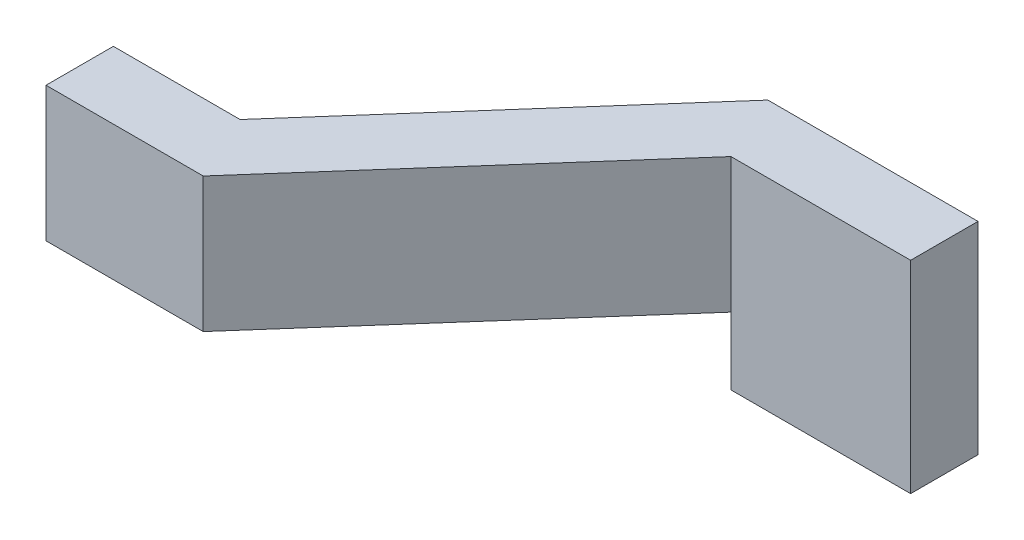
ISO-10303-21;
HEADER;
FILE_DESCRIPTION(('STEP AP214'),'2;1');
FILE_NAME('part.step','',(''),(''),'','','');
FILE_SCHEMA(('AUTOMOTIVE_DESIGN { 1 0 10303 214 1 1 1 1 }'));
ENDSEC;
DATA;
#1=APPLICATION_CONTEXT('core data for automotive mechanical design processes');
#2=APPLICATION_PROTOCOL_DEFINITION('international standard','automotive_design',2000,#1);
#3=PRODUCT_CONTEXT('',#1,'mechanical');
#4=PRODUCT('Part','Part','',(#3));
#5=PRODUCT_RELATED_PRODUCT_CATEGORY('part','',(#4));
#6=PRODUCT_DEFINITION_FORMATION('','',#4);
#7=PRODUCT_DEFINITION_CONTEXT('part definition',#1,'design');
#8=PRODUCT_DEFINITION('design','',#6,#7);
#9=PRODUCT_DEFINITION_SHAPE('','',#8);
#10=(LENGTH_UNIT() NAMED_UNIT(*) SI_UNIT(.MILLI.,.METRE.));
#11=(NAMED_UNIT(*) PLANE_ANGLE_UNIT() SI_UNIT($,.RADIAN.));
#12=(NAMED_UNIT(*) SI_UNIT($,.STERADIAN.) SOLID_ANGLE_UNIT());
#13=UNCERTAINTY_MEASURE_WITH_UNIT(LENGTH_MEASURE(1.E-05),#10,'distance_accuracy_value','');
#14=(GEOMETRIC_REPRESENTATION_CONTEXT(3) GLOBAL_UNCERTAINTY_ASSIGNED_CONTEXT((#13)) GLOBAL_UNIT_ASSIGNED_CONTEXT((#10,
#11,#12)) REPRESENTATION_CONTEXT('',''));
#15=CARTESIAN_POINT('',(0.,0.,0.));
#16=DIRECTION('',(0.,0.,1.));
#17=DIRECTION('',(1.,0.,0.));
#18=AXIS2_PLACEMENT_3D('',#15,#16,#17);
#19=CARTESIAN_POINT('',(0.,0.762,0.));
#20=DIRECTION('',(1.,0.,0.));
#21=DIRECTION('',(0.,0.,-1.));
#22=AXIS2_PLACEMENT_3D('',#19,#20,#21);
#23=PLANE('',#22);
#24=DIRECTION('',(0.,0.,-1.));
#25=VECTOR('',#24,1.);
#26=CARTESIAN_POINT('',(0.,-0.381,0.));
#27=LINE('',#26,#25);
#28=CARTESIAN_POINT('',(0.,-0.381,0.));
#29=VERTEX_POINT('',#28);
#30=CARTESIAN_POINT('',(0.,-0.381,-0.381));
#31=VERTEX_POINT('',#30);
#32=EDGE_CURVE('E196',#29,#31,#27,.T.);
#33=ORIENTED_EDGE('',*,*,#32,.F.);
#34=DIRECTION('',(0.,-1.,0.));
#35=VECTOR('',#34,1.);
#36=CARTESIAN_POINT('',(0.,0.762,0.));
#37=LINE('',#36,#35);
#38=CARTESIAN_POINT('',(0.,0.381,0.));
#39=VERTEX_POINT('',#38);
#40=EDGE_CURVE('E141',#39,#29,#37,.T.);
#41=ORIENTED_EDGE('',*,*,#40,.F.);
#42=DIRECTION('',(0.,0.,-1.));
#43=VECTOR('',#42,1.);
#44=CARTESIAN_POINT('',(0.,0.381,0.));
#45=LINE('',#44,#43);
#46=CARTESIAN_POINT('',(0.,0.381,-0.381));
#47=VERTEX_POINT('',#46);
#48=EDGE_CURVE('E180',#39,#47,#45,.T.);
#49=ORIENTED_EDGE('',*,*,#48,.T.);
#50=DIRECTION('',(0.,-1.,0.));
#51=VECTOR('',#50,1.);
#52=CARTESIAN_POINT('',(0.,0.762,-0.381));
#53=LINE('',#52,#51);
#54=EDGE_CURVE('E153',#47,#31,#53,.T.);
#55=ORIENTED_EDGE('',*,*,#54,.T.);
#56=EDGE_LOOP('',(#33,#41,#49,#55));
#57=FACE_BOUND('',#56,.T.);
#58=ADVANCED_FACE('F34',(#57),#23,.F.);
#59=CARTESIAN_POINT('',(0.,0.762,0.));
#60=DIRECTION('',(0.,0.,-1.));
#61=DIRECTION('',(-1.,0.,0.));
#62=AXIS2_PLACEMENT_3D('',#59,#60,#61);
#63=PLANE('',#62);
#64=DIRECTION('',(-1.,0.,0.));
#65=VECTOR('',#64,1.);
#66=CARTESIAN_POINT('',(0.,-0.381,0.));
#67=LINE('',#66,#65);
#68=CARTESIAN_POINT('',(0.888999999999999,-0.381,0.));
#69=VERTEX_POINT('',#68);
#70=EDGE_CURVE('E204',#69,#29,#67,.T.);
#71=ORIENTED_EDGE('',*,*,#70,.F.);
#72=DIRECTION('',(0.,-1.,0.));
#73=VECTOR('',#72,1.);
#74=CARTESIAN_POINT('',(0.889,0.762,0.));
#75=LINE('',#74,#73);
#76=CARTESIAN_POINT('',(0.889,0.381,0.));
#77=VERTEX_POINT('',#76);
#78=EDGE_CURVE('E138',#77,#69,#75,.T.);
#79=ORIENTED_EDGE('',*,*,#78,.F.);
#80=DIRECTION('',(-1.,0.,0.));
#81=VECTOR('',#80,1.);
#82=CARTESIAN_POINT('',(0.,0.381,0.));
#83=LINE('',#82,#81);
#84=EDGE_CURVE('E113',#77,#39,#83,.T.);
#85=ORIENTED_EDGE('',*,*,#84,.T.);
#86=ORIENTED_EDGE('',*,*,#40,.T.);
#87=EDGE_LOOP('',(#71,#79,#85,#86));
#88=FACE_BOUND('',#87,.T.);
#89=ADVANCED_FACE('F202',(#88),#63,.F.);
#90=CARTESIAN_POINT('',(0.889,0.762,0.));
#91=DIRECTION('',(-0.750713516922755,0.,-0.660627894892025));
#92=DIRECTION('',(-0.660627894892025,0.,0.750713516922755));
#93=AXIS2_PLACEMENT_3D('',#90,#91,#92);
#94=PLANE('',#93);
#95=DIRECTION('',(-0.660627894892025,0.,0.750713516922755));
#96=VECTOR('',#95,1.);
#97=CARTESIAN_POINT('',(0.889,-0.381,0.));
#98=LINE('',#97,#96);
#99=CARTESIAN_POINT('',(2.286,-0.381,-1.5875));
#100=VERTEX_POINT('',#99);
#101=EDGE_CURVE('E114',#100,#69,#98,.T.);
#102=ORIENTED_EDGE('',*,*,#101,.F.);
#103=DIRECTION('',(0.,-1.,0.));
#104=VECTOR('',#103,1.);
#105=CARTESIAN_POINT('',(2.286,0.762,-1.5875));
#106=LINE('',#105,#104);
#107=CARTESIAN_POINT('',(2.286,0.381,-1.5875));
#108=VERTEX_POINT('',#107);
#109=EDGE_CURVE('E130',#108,#100,#106,.T.);
#110=ORIENTED_EDGE('',*,*,#109,.F.);
#111=DIRECTION('',(-0.660627894892025,0.,0.750713516922755));
#112=VECTOR('',#111,1.);
#113=CARTESIAN_POINT('',(0.889,0.381,0.));
#114=LINE('',#113,#112);
#115=EDGE_CURVE('E185',#108,#77,#114,.T.);
#116=ORIENTED_EDGE('',*,*,#115,.T.);
#117=ORIENTED_EDGE('',*,*,#78,.T.);
#118=EDGE_LOOP('',(#102,#110,#116,#117));
#119=FACE_BOUND('',#118,.T.);
#120=ADVANCED_FACE('F199',(#119),#94,.F.);
#121=CARTESIAN_POINT('',(3.302,0.762,-1.9685));
#122=DIRECTION('',(0.,0.,1.));
#123=DIRECTION('',(1.,0.,0.));
#124=AXIS2_PLACEMENT_3D('',#121,#122,#123);
#125=PLANE('',#124);
#126=DIRECTION('',(-1.,0.,0.));
#127=VECTOR('',#126,1.);
#128=CARTESIAN_POINT('',(0.,0.381,-1.9685));
#129=LINE('',#128,#127);
#130=CARTESIAN_POINT('',(3.302,0.381,-1.9685));
#131=VERTEX_POINT('',#130);
#132=CARTESIAN_POINT('',(2.11376282945303,0.381,-1.9685));
#133=VERTEX_POINT('',#132);
#134=EDGE_CURVE('E105',#131,#133,#129,.T.);
#135=ORIENTED_EDGE('',*,*,#134,.F.);
#136=DIRECTION('',(0.,-1.,0.));
#137=VECTOR('',#136,1.);
#138=CARTESIAN_POINT('',(3.302,0.762,-1.9685));
#139=LINE('',#138,#137);
#140=CARTESIAN_POINT('',(3.302,-0.762,-1.9685));
#141=VERTEX_POINT('',#140);
#142=EDGE_CURVE('E56',#131,#141,#139,.T.);
#143=ORIENTED_EDGE('',*,*,#142,.T.);
#144=DIRECTION('',(-1.,0.,0.));
#145=VECTOR('',#144,1.);
#146=CARTESIAN_POINT('',(3.302,-0.762,-1.9685));
#147=LINE('',#146,#145);
#148=CARTESIAN_POINT('',(2.286,-0.762,-1.9685));
#149=VERTEX_POINT('',#148);
#150=EDGE_CURVE('E149',#141,#149,#147,.T.);
#151=ORIENTED_EDGE('',*,*,#150,.T.);
#152=DIRECTION('',(0.,1.,0.));
#153=VECTOR('',#152,1.);
#154=CARTESIAN_POINT('',(2.286,-0.762,-1.9685));
#155=LINE('',#154,#153);
#156=CARTESIAN_POINT('',(2.286,-0.381,-1.9685));
#157=VERTEX_POINT('',#156);
#158=EDGE_CURVE('E48',#149,#157,#155,.T.);
#159=ORIENTED_EDGE('',*,*,#158,.T.);
#160=DIRECTION('',(-1.,0.,0.));
#161=VECTOR('',#160,1.);
#162=CARTESIAN_POINT('',(0.,-0.381,-1.9685));
#163=LINE('',#162,#161);
#164=CARTESIAN_POINT('',(2.11376282945303,-0.381,-1.9685));
#165=VERTEX_POINT('',#164);
#166=EDGE_CURVE('E195',#157,#165,#163,.T.);
#167=ORIENTED_EDGE('',*,*,#166,.T.);
#168=DIRECTION('',(0.,-1.,0.));
#169=VECTOR('',#168,1.);
#170=CARTESIAN_POINT('',(2.11376282945303,0.762,-1.9685));
#171=LINE('',#170,#169);
#172=EDGE_CURVE('E110',#133,#165,#171,.T.);
#173=ORIENTED_EDGE('',*,*,#172,.F.);
#174=EDGE_LOOP('',(#135,#143,#151,#159,#167,#173));
#175=FACE_BOUND('',#174,.T.);
#176=ADVANCED_FACE('F107',(#175),#125,.F.);
#177=CARTESIAN_POINT('',(0.716762829453032,0.762,-0.381));
#178=DIRECTION('',(0.750713516922755,0.,0.660627894892025));
#179=DIRECTION('',(0.660627894892025,0.,-0.750713516922755));
#180=AXIS2_PLACEMENT_3D('',#177,#178,#179);
#181=PLANE('',#180);
#182=DIRECTION('',(0.660627894892025,0.,-0.750713516922755));
#183=VECTOR('',#182,1.);
#184=CARTESIAN_POINT('',(0.716762829453032,-0.381,-0.381));
#185=LINE('',#184,#183);
#186=CARTESIAN_POINT('',(0.716762829453032,-0.381,-0.381));
#187=VERTEX_POINT('',#186);
#188=EDGE_CURVE('E169',#187,#165,#185,.T.);
#189=ORIENTED_EDGE('',*,*,#188,.F.);
#190=DIRECTION('',(0.,-1.,0.));
#191=VECTOR('',#190,1.);
#192=CARTESIAN_POINT('',(0.716762829453032,0.762,-0.381));
#193=LINE('',#192,#191);
#194=CARTESIAN_POINT('',(0.716762829453032,0.381,-0.381));
#195=VERTEX_POINT('',#194);
#196=EDGE_CURVE('E132',#195,#187,#193,.T.);
#197=ORIENTED_EDGE('',*,*,#196,.F.);
#198=DIRECTION('',(0.660627894892025,0.,-0.750713516922755));
#199=VECTOR('',#198,1.);
#200=CARTESIAN_POINT('',(0.716762829453032,0.381,-0.381));
#201=LINE('',#200,#199);
#202=EDGE_CURVE('E168',#195,#133,#201,.T.);
#203=ORIENTED_EDGE('',*,*,#202,.T.);
#204=ORIENTED_EDGE('',*,*,#172,.T.);
#205=EDGE_LOOP('',(#189,#197,#203,#204));
#206=FACE_BOUND('',#205,.T.);
#207=ADVANCED_FACE('F167',(#206),#181,.F.);
#208=CARTESIAN_POINT('',(0.,0.762,-0.381));
#209=DIRECTION('',(0.,0.,1.));
#210=DIRECTION('',(1.,0.,0.));
#211=AXIS2_PLACEMENT_3D('',#208,#209,#210);
#212=PLANE('',#211);
#213=DIRECTION('',(1.,0.,0.));
#214=VECTOR('',#213,1.);
#215=CARTESIAN_POINT('',(0.,-0.381,-0.381));
#216=LINE('',#215,#214);
#217=EDGE_CURVE('E11',#31,#187,#216,.T.);
#218=ORIENTED_EDGE('',*,*,#217,.F.);
#219=ORIENTED_EDGE('',*,*,#54,.F.);
#220=DIRECTION('',(1.,0.,0.));
#221=VECTOR('',#220,1.);
#222=CARTESIAN_POINT('',(0.,0.381,-0.381));
#223=LINE('',#222,#221);
#224=EDGE_CURVE('E144',#47,#195,#223,.T.);
#225=ORIENTED_EDGE('',*,*,#224,.T.);
#226=ORIENTED_EDGE('',*,*,#196,.T.);
#227=EDGE_LOOP('',(#218,#219,#225,#226));
#228=FACE_BOUND('',#227,.T.);
#229=ADVANCED_FACE('F163',(#228),#212,.F.);
#230=CARTESIAN_POINT('',(0.,-0.762,0.));
#231=DIRECTION('',(0.,-1.,0.));
#232=DIRECTION('',(0.,0.,-1.));
#233=AXIS2_PLACEMENT_3D('',#230,#231,#232);
#234=PLANE('',#233);
#235=DIRECTION('',(1.,0.,0.));
#236=VECTOR('',#235,1.);
#237=CARTESIAN_POINT('',(2.286,-0.762,-1.5875));
#238=LINE('',#237,#236);
#239=CARTESIAN_POINT('',(2.286,-0.762,-1.5875));
#240=VERTEX_POINT('',#239);
#241=CARTESIAN_POINT('',(3.302,-0.762,-1.5875));
#242=VERTEX_POINT('',#241);
#243=EDGE_CURVE('E151',#240,#242,#238,.T.);
#244=ORIENTED_EDGE('',*,*,#243,.F.);
#245=DIRECTION('',(0.,0.,-1.));
#246=VECTOR('',#245,1.);
#247=CARTESIAN_POINT('',(2.286,-0.762,0.));
#248=LINE('',#247,#246);
#249=EDGE_CURVE('E41',#240,#149,#248,.T.);
#250=ORIENTED_EDGE('',*,*,#249,.T.);
#251=ORIENTED_EDGE('',*,*,#150,.F.);
#252=DIRECTION('',(0.,0.,-1.));
#253=VECTOR('',#252,1.);
#254=CARTESIAN_POINT('',(3.302,-0.762,-1.5875));
#255=LINE('',#254,#253);
#256=EDGE_CURVE('E126',#242,#141,#255,.T.);
#257=ORIENTED_EDGE('',*,*,#256,.F.);
#258=EDGE_LOOP('',(#244,#250,#251,#257));
#259=FACE_BOUND('',#258,.T.);
#260=ADVANCED_FACE('F148',(#259),#234,.T.);
#261=CARTESIAN_POINT('',(2.286,0.762,-1.5875));
#262=DIRECTION('',(0.,0.,-1.));
#263=DIRECTION('',(-1.,0.,0.));
#264=AXIS2_PLACEMENT_3D('',#261,#262,#263);
#265=PLANE('',#264);
#266=DIRECTION('',(0.,-1.,0.));
#267=VECTOR('',#266,1.);
#268=CARTESIAN_POINT('',(3.302,0.762,-1.5875));
#269=LINE('',#268,#267);
#270=CARTESIAN_POINT('',(3.302,0.381,-1.5875));
#271=VERTEX_POINT('',#270);
#272=EDGE_CURVE('E128',#271,#242,#269,.T.);
#273=ORIENTED_EDGE('',*,*,#272,.F.);
#274=DIRECTION('',(-1.,0.,0.));
#275=VECTOR('',#274,1.);
#276=CARTESIAN_POINT('',(2.286,0.381,-1.5875));
#277=LINE('',#276,#275);
#278=EDGE_CURVE('E120',#271,#108,#277,.T.);
#279=ORIENTED_EDGE('',*,*,#278,.T.);
#280=ORIENTED_EDGE('',*,*,#109,.T.);
#281=DIRECTION('',(0.,1.,0.));
#282=VECTOR('',#281,1.);
#283=CARTESIAN_POINT('',(2.286,0.762,-1.5875));
#284=LINE('',#283,#282);
#285=EDGE_CURVE('E172',#240,#100,#284,.T.);
#286=ORIENTED_EDGE('',*,*,#285,.F.);
#287=ORIENTED_EDGE('',*,*,#243,.T.);
#288=EDGE_LOOP('',(#273,#279,#280,#286,#287));
#289=FACE_BOUND('',#288,.T.);
#290=ADVANCED_FACE('F188',(#289),#265,.F.);
#291=CARTESIAN_POINT('',(3.302,0.762,-1.5875));
#292=DIRECTION('',(-1.,0.,0.));
#293=DIRECTION('',(0.,0.,1.));
#294=AXIS2_PLACEMENT_3D('',#291,#292,#293);
#295=PLANE('',#294);
#296=ORIENTED_EDGE('',*,*,#142,.F.);
#297=DIRECTION('',(0.,0.,-1.));
#298=VECTOR('',#297,1.);
#299=CARTESIAN_POINT('',(3.302,0.381,0.));
#300=LINE('',#299,#298);
#301=EDGE_CURVE('E117',#271,#131,#300,.T.);
#302=ORIENTED_EDGE('',*,*,#301,.F.);
#303=ORIENTED_EDGE('',*,*,#272,.T.);
#304=ORIENTED_EDGE('',*,*,#256,.T.);
#305=EDGE_LOOP('',(#296,#302,#303,#304));
#306=FACE_BOUND('',#305,.T.);
#307=ADVANCED_FACE('F124',(#306),#295,.F.);
#308=CARTESIAN_POINT('',(0.,0.381,0.));
#309=DIRECTION('',(0.,-1.,0.));
#310=DIRECTION('',(1.,0.,0.));
#311=AXIS2_PLACEMENT_3D('',#308,#309,#310);
#312=PLANE('',#311);
#313=ORIENTED_EDGE('',*,*,#115,.F.);
#314=ORIENTED_EDGE('',*,*,#278,.F.);
#315=ORIENTED_EDGE('',*,*,#301,.T.);
#316=ORIENTED_EDGE('',*,*,#134,.T.);
#317=ORIENTED_EDGE('',*,*,#202,.F.);
#318=ORIENTED_EDGE('',*,*,#224,.F.);
#319=ORIENTED_EDGE('',*,*,#48,.F.);
#320=ORIENTED_EDGE('',*,*,#84,.F.);
#321=EDGE_LOOP('',(#313,#314,#315,#316,#317,#318,#319,#320));
#322=FACE_BOUND('',#321,.T.);
#323=ADVANCED_FACE('F119',(#322),#312,.F.);
#324=CARTESIAN_POINT('',(0.,-0.381,0.));
#325=DIRECTION('',(0.,-1.,0.));
#326=DIRECTION('',(1.,0.,0.));
#327=AXIS2_PLACEMENT_3D('',#324,#325,#326);
#328=PLANE('',#327);
#329=ORIENTED_EDGE('',*,*,#101,.T.);
#330=ORIENTED_EDGE('',*,*,#70,.T.);
#331=ORIENTED_EDGE('',*,*,#32,.T.);
#332=ORIENTED_EDGE('',*,*,#217,.T.);
#333=ORIENTED_EDGE('',*,*,#188,.T.);
#334=ORIENTED_EDGE('',*,*,#166,.F.);
#335=DIRECTION('',(0.,0.,-1.));
#336=VECTOR('',#335,1.);
#337=CARTESIAN_POINT('',(2.286,-0.381,0.));
#338=LINE('',#337,#336);
#339=EDGE_CURVE('E175',#100,#157,#338,.T.);
#340=ORIENTED_EDGE('',*,*,#339,.F.);
#341=EDGE_LOOP('',(#329,#330,#331,#332,#333,#334,#340));
#342=FACE_BOUND('',#341,.T.);
#343=ADVANCED_FACE('F193',(#342),#328,.T.);
#344=CARTESIAN_POINT('',(2.286,-0.762,0.));
#345=DIRECTION('',(-1.,0.,0.));
#346=DIRECTION('',(0.,0.,1.));
#347=AXIS2_PLACEMENT_3D('',#344,#345,#346);
#348=PLANE('',#347);
#349=ORIENTED_EDGE('',*,*,#285,.T.);
#350=ORIENTED_EDGE('',*,*,#339,.T.);
#351=ORIENTED_EDGE('',*,*,#158,.F.);
#352=ORIENTED_EDGE('',*,*,#249,.F.);
#353=EDGE_LOOP('',(#349,#350,#351,#352));
#354=FACE_BOUND('',#353,.T.);
#355=ADVANCED_FACE('F191',(#354),#348,.T.);
#356=CLOSED_SHELL('',(#58,#89,#120,#176,#207,#229,#260,#290,#307,#323,#343,#355));
#357=MANIFOLD_SOLID_BREP('B2',#356);
#358=ADVANCED_BREP_SHAPE_REPRESENTATION('',(#18,#357),#14);
#359=SHAPE_DEFINITION_REPRESENTATION(#9,#358);
ENDSEC;
END-ISO-10303-21;
